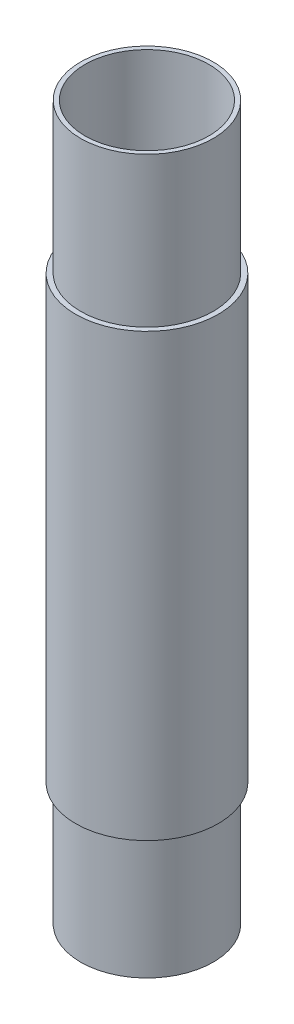
ISO-10303-21;
HEADER;
FILE_DESCRIPTION(('STEP AP214'),'2;1');
FILE_NAME('part.step','',(''),(''),'','','');
FILE_SCHEMA(('AUTOMOTIVE_DESIGN { 1 0 10303 214 1 1 1 1 }'));
ENDSEC;
DATA;
#1=APPLICATION_CONTEXT('core data for automotive mechanical design processes');
#2=APPLICATION_PROTOCOL_DEFINITION('international standard','automotive_design',2000,#1);
#3=PRODUCT_CONTEXT('',#1,'mechanical');
#4=PRODUCT('Part','Part','',(#3));
#5=PRODUCT_RELATED_PRODUCT_CATEGORY('part','',(#4));
#6=PRODUCT_DEFINITION_FORMATION('','',#4);
#7=PRODUCT_DEFINITION_CONTEXT('part definition',#1,'design');
#8=PRODUCT_DEFINITION('design','',#6,#7);
#9=PRODUCT_DEFINITION_SHAPE('','',#8);
#10=(LENGTH_UNIT() NAMED_UNIT(*) SI_UNIT(.MILLI.,.METRE.));
#11=(NAMED_UNIT(*) PLANE_ANGLE_UNIT() SI_UNIT($,.RADIAN.));
#12=(NAMED_UNIT(*) SI_UNIT($,.STERADIAN.) SOLID_ANGLE_UNIT());
#13=UNCERTAINTY_MEASURE_WITH_UNIT(LENGTH_MEASURE(1.E-05),#10,'distance_accuracy_value','');
#14=(GEOMETRIC_REPRESENTATION_CONTEXT(3) GLOBAL_UNCERTAINTY_ASSIGNED_CONTEXT((#13)) GLOBAL_UNIT_ASSIGNED_CONTEXT((#10,
#11,#12)) REPRESENTATION_CONTEXT('',''));
#15=CARTESIAN_POINT('',(0.,0.,0.));
#16=DIRECTION('',(0.,0.,1.));
#17=DIRECTION('',(1.,0.,0.));
#18=AXIS2_PLACEMENT_3D('',#15,#16,#17);
#19=CARTESIAN_POINT('',(0.,230.,0.));
#20=DIRECTION('',(0.,-1.,0.));
#21=DIRECTION('',(0.,0.,-1.));
#22=AXIS2_PLACEMENT_3D('',#19,#20,#21);
#23=CYLINDRICAL_SURFACE('',#22,27.06751);
#24=CARTESIAN_POINT('',(0.,80.,0.));
#25=DIRECTION('',(0.,1.,0.));
#26=DIRECTION('',(0.,0.,1.));
#27=AXIS2_PLACEMENT_3D('',#24,#25,#26);
#28=CIRCLE('',#27,27.06751);
#29=CARTESIAN_POINT('',(0.,80.,27.06751));
#30=VERTEX_POINT('',#29);
#31=EDGE_CURVE('E56',#30,#30,#28,.F.);
#32=ORIENTED_EDGE('',*,*,#31,.T.);
#33=EDGE_LOOP('',(#32));
#34=FACE_BOUND('',#33,.T.);
#35=CARTESIAN_POINT('',(0.,200.,0.));
#36=DIRECTION('',(0.,1.,0.));
#37=DIRECTION('',(0.,0.,1.));
#38=AXIS2_PLACEMENT_3D('',#35,#36,#37);
#39=CIRCLE('',#38,27.06751);
#40=CARTESIAN_POINT('',(0.,200.,27.06751));
#41=VERTEX_POINT('',#40);
#42=EDGE_CURVE('E84',#41,#41,#39,.T.);
#43=ORIENTED_EDGE('',*,*,#42,.T.);
#44=EDGE_LOOP('',(#43));
#45=FACE_BOUND('',#44,.T.);
#46=ADVANCED_FACE('F37',(#34,#45),#23,.F.);
#47=CARTESIAN_POINT('',(0.,80.,0.));
#48=DIRECTION('',(0.,-1.,0.));
#49=DIRECTION('',(0.,0.,-1.));
#50=AXIS2_PLACEMENT_3D('',#47,#48,#49);
#51=CYLINDRICAL_SURFACE('',#50,27.06751);
#52=CARTESIAN_POINT('',(0.,0.,0.));
#53=DIRECTION('',(0.,1.,0.));
#54=DIRECTION('',(0.,0.,1.));
#55=AXIS2_PLACEMENT_3D('',#52,#53,#54);
#56=CIRCLE('',#55,27.06751);
#57=CARTESIAN_POINT('',(0.,0.,27.06751));
#58=VERTEX_POINT('',#57);
#59=EDGE_CURVE('E48',#58,#58,#56,.T.);
#60=ORIENTED_EDGE('',*,*,#59,.T.);
#61=EDGE_LOOP('',(#60));
#62=FACE_BOUND('',#61,.T.);
#63=CARTESIAN_POINT('',(0.,50.,0.));
#64=DIRECTION('',(0.,1.,0.));
#65=DIRECTION('',(0.,0.,1.));
#66=AXIS2_PLACEMENT_3D('',#63,#64,#65);
#67=CIRCLE('',#66,27.06751);
#68=CARTESIAN_POINT('',(0.,50.,27.06751));
#69=VERTEX_POINT('',#68);
#70=EDGE_CURVE('E10',#69,#69,#67,.T.);
#71=ORIENTED_EDGE('',*,*,#70,.F.);
#72=EDGE_LOOP('',(#71));
#73=FACE_BOUND('',#72,.T.);
#74=ADVANCED_FACE('F106',(#62,#73),#51,.T.);
#75=CARTESIAN_POINT('',(0.,80.,0.));
#76=DIRECTION('',(0.,-1.,0.));
#77=DIRECTION('',(0.,0.,-1.));
#78=AXIS2_PLACEMENT_3D('',#75,#76,#77);
#79=CYLINDRICAL_SURFACE('',#78,25.29025);
#80=CARTESIAN_POINT('',(0.,80.,0.));
#81=DIRECTION('',(0.,1.,0.));
#82=DIRECTION('',(0.,0.,1.));
#83=AXIS2_PLACEMENT_3D('',#80,#81,#82);
#84=CIRCLE('',#83,25.29025);
#85=CARTESIAN_POINT('',(0.,80.,25.29025));
#86=VERTEX_POINT('',#85);
#87=EDGE_CURVE('E44',#86,#86,#84,.T.);
#88=ORIENTED_EDGE('',*,*,#87,.T.);
#89=EDGE_LOOP('',(#88));
#90=FACE_BOUND('',#89,.T.);
#91=CARTESIAN_POINT('',(0.,0.,0.));
#92=DIRECTION('',(0.,1.,0.));
#93=DIRECTION('',(0.,0.,1.));
#94=AXIS2_PLACEMENT_3D('',#91,#92,#93);
#95=CIRCLE('',#94,25.29025);
#96=CARTESIAN_POINT('',(0.,0.,25.29025));
#97=VERTEX_POINT('',#96);
#98=EDGE_CURVE('E53',#97,#97,#95,.T.);
#99=ORIENTED_EDGE('',*,*,#98,.F.);
#100=EDGE_LOOP('',(#99));
#101=FACE_BOUND('',#100,.T.);
#102=ADVANCED_FACE('F39',(#90,#101),#79,.F.);
#103=CARTESIAN_POINT('',(0.,80.,0.));
#104=DIRECTION('',(0.,1.,0.));
#105=DIRECTION('',(0.,0.,1.));
#106=AXIS2_PLACEMENT_3D('',#103,#104,#105);
#107=PLANE('',#106);
#108=ORIENTED_EDGE('',*,*,#87,.F.);
#109=EDGE_LOOP('',(#108));
#110=FACE_BOUND('',#109,.T.);
#111=ORIENTED_EDGE('',*,*,#31,.F.);
#112=EDGE_LOOP('',(#111));
#113=FACE_BOUND('',#112,.T.);
#114=ADVANCED_FACE('F116',(#110,#113),#107,.T.);
#115=CARTESIAN_POINT('',(0.,0.,0.));
#116=DIRECTION('',(0.,1.,0.));
#117=DIRECTION('',(0.,0.,1.));
#118=AXIS2_PLACEMENT_3D('',#115,#116,#117);
#119=PLANE('',#118);
#120=ORIENTED_EDGE('',*,*,#98,.T.);
#121=EDGE_LOOP('',(#120));
#122=FACE_BOUND('',#121,.T.);
#123=ORIENTED_EDGE('',*,*,#59,.F.);
#124=EDGE_LOOP('',(#123));
#125=FACE_BOUND('',#124,.T.);
#126=ADVANCED_FACE('F119',(#122,#125),#119,.F.);
#127=CARTESIAN_POINT('',(0.,230.,0.));
#128=DIRECTION('',(0.,-1.,0.));
#129=DIRECTION('',(0.,0.,-1.));
#130=AXIS2_PLACEMENT_3D('',#127,#128,#129);
#131=CYLINDRICAL_SURFACE('',#130,29.1211);
#132=CARTESIAN_POINT('',(0.,230.,0.));
#133=DIRECTION('',(0.,1.,0.));
#134=DIRECTION('',(0.,0.,1.));
#135=AXIS2_PLACEMENT_3D('',#132,#133,#134);
#136=CIRCLE('',#135,29.1211);
#137=CARTESIAN_POINT('',(0.,230.,29.1211));
#138=VERTEX_POINT('',#137);
#139=EDGE_CURVE('E62',#138,#138,#136,.T.);
#140=ORIENTED_EDGE('',*,*,#139,.F.);
#141=EDGE_LOOP('',(#140));
#142=FACE_BOUND('',#141,.T.);
#143=CARTESIAN_POINT('',(0.,50.,0.));
#144=DIRECTION('',(0.,1.,0.));
#145=DIRECTION('',(0.,0.,1.));
#146=AXIS2_PLACEMENT_3D('',#143,#144,#145);
#147=CIRCLE('',#146,29.1211);
#148=CARTESIAN_POINT('',(0.,50.,29.1211));
#149=VERTEX_POINT('',#148);
#150=EDGE_CURVE('E71',#149,#149,#147,.T.);
#151=ORIENTED_EDGE('',*,*,#150,.T.);
#152=EDGE_LOOP('',(#151));
#153=FACE_BOUND('',#152,.T.);
#154=ADVANCED_FACE('F114',(#142,#153),#131,.T.);
#155=CARTESIAN_POINT('',(0.,230.,0.));
#156=DIRECTION('',(0.,1.,0.));
#157=DIRECTION('',(0.,0.,1.));
#158=AXIS2_PLACEMENT_3D('',#155,#156,#157);
#159=PLANE('',#158);
#160=CARTESIAN_POINT('',(0.,230.,0.));
#161=DIRECTION('',(0.,1.,0.));
#162=DIRECTION('',(0.,0.,1.));
#163=AXIS2_PLACEMENT_3D('',#160,#161,#162);
#164=CIRCLE('',#163,27.06751);
#165=CARTESIAN_POINT('',(0.,230.,27.06751));
#166=VERTEX_POINT('',#165);
#167=EDGE_CURVE('E66',#166,#166,#164,.T.);
#168=ORIENTED_EDGE('',*,*,#167,.F.);
#169=EDGE_LOOP('',(#168));
#170=FACE_BOUND('',#169,.T.);
#171=ORIENTED_EDGE('',*,*,#139,.T.);
#172=EDGE_LOOP('',(#171));
#173=FACE_BOUND('',#172,.T.);
#174=ADVANCED_FACE('F125',(#170,#173),#159,.T.);
#175=CARTESIAN_POINT('',(0.,50.,0.));
#176=DIRECTION('',(0.,1.,0.));
#177=DIRECTION('',(0.,0.,1.));
#178=AXIS2_PLACEMENT_3D('',#175,#176,#177);
#179=PLANE('',#178);
#180=ORIENTED_EDGE('',*,*,#70,.T.);
#181=EDGE_LOOP('',(#180));
#182=FACE_BOUND('',#181,.T.);
#183=ORIENTED_EDGE('',*,*,#150,.F.);
#184=EDGE_LOOP('',(#183));
#185=FACE_BOUND('',#184,.T.);
#186=ADVANCED_FACE('F133',(#182,#185),#179,.F.);
#187=CARTESIAN_POINT('',(0.,291.12,0.));
#188=DIRECTION('',(0.,-1.,0.));
#189=DIRECTION('',(0.,0.,-1.));
#190=AXIS2_PLACEMENT_3D('',#187,#188,#189);
#191=CYLINDRICAL_SURFACE('',#190,25.29025);
#192=CARTESIAN_POINT('',(0.,291.12,0.));
#193=DIRECTION('',(0.,1.,0.));
#194=DIRECTION('',(0.,0.,1.));
#195=AXIS2_PLACEMENT_3D('',#192,#193,#194);
#196=CIRCLE('',#195,25.29025);
#197=CARTESIAN_POINT('',(0.,291.12,25.29025));
#198=VERTEX_POINT('',#197);
#199=EDGE_CURVE('E79',#198,#198,#196,.T.);
#200=ORIENTED_EDGE('',*,*,#199,.T.);
#201=EDGE_LOOP('',(#200));
#202=FACE_BOUND('',#201,.T.);
#203=CARTESIAN_POINT('',(0.,200.,0.));
#204=DIRECTION('',(0.,1.,0.));
#205=DIRECTION('',(0.,0.,1.));
#206=AXIS2_PLACEMENT_3D('',#203,#204,#205);
#207=CIRCLE('',#206,25.29025);
#208=CARTESIAN_POINT('',(0.,200.,25.29025));
#209=VERTEX_POINT('',#208);
#210=EDGE_CURVE('E87',#209,#209,#207,.T.);
#211=ORIENTED_EDGE('',*,*,#210,.F.);
#212=EDGE_LOOP('',(#211));
#213=FACE_BOUND('',#212,.T.);
#214=ADVANCED_FACE('F139',(#202,#213),#191,.F.);
#215=CARTESIAN_POINT('',(0.,291.12,0.));
#216=DIRECTION('',(0.,-1.,0.));
#217=DIRECTION('',(0.,0.,-1.));
#218=AXIS2_PLACEMENT_3D('',#215,#216,#217);
#219=CYLINDRICAL_SURFACE('',#218,27.06751);
#220=ORIENTED_EDGE('',*,*,#167,.T.);
#221=EDGE_LOOP('',(#220));
#222=FACE_BOUND('',#221,.T.);
#223=CARTESIAN_POINT('',(0.,291.12,0.));
#224=DIRECTION('',(0.,1.,0.));
#225=DIRECTION('',(0.,0.,1.));
#226=AXIS2_PLACEMENT_3D('',#223,#224,#225);
#227=CIRCLE('',#226,27.06751);
#228=CARTESIAN_POINT('',(0.,291.12,27.06751));
#229=VERTEX_POINT('',#228);
#230=EDGE_CURVE('E75',#229,#229,#227,.T.);
#231=ORIENTED_EDGE('',*,*,#230,.F.);
#232=EDGE_LOOP('',(#231));
#233=FACE_BOUND('',#232,.T.);
#234=ADVANCED_FACE('F101',(#222,#233),#219,.T.);
#235=CARTESIAN_POINT('',(0.,291.12,0.));
#236=DIRECTION('',(0.,1.,0.));
#237=DIRECTION('',(0.,0.,1.));
#238=AXIS2_PLACEMENT_3D('',#235,#236,#237);
#239=PLANE('',#238);
#240=ORIENTED_EDGE('',*,*,#199,.F.);
#241=EDGE_LOOP('',(#240));
#242=FACE_BOUND('',#241,.T.);
#243=ORIENTED_EDGE('',*,*,#230,.T.);
#244=EDGE_LOOP('',(#243));
#245=FACE_BOUND('',#244,.T.);
#246=ADVANCED_FACE('F95',(#242,#245),#239,.T.);
#247=CARTESIAN_POINT('',(0.,200.,0.));
#248=DIRECTION('',(0.,1.,0.));
#249=DIRECTION('',(0.,0.,1.));
#250=AXIS2_PLACEMENT_3D('',#247,#248,#249);
#251=PLANE('',#250);
#252=ORIENTED_EDGE('',*,*,#210,.T.);
#253=EDGE_LOOP('',(#252));
#254=FACE_BOUND('',#253,.T.);
#255=ORIENTED_EDGE('',*,*,#42,.F.);
#256=EDGE_LOOP('',(#255));
#257=FACE_BOUND('',#256,.T.);
#258=ADVANCED_FACE('F93',(#254,#257),#251,.F.);
#259=CLOSED_SHELL('',(#46,#74,#102,#114,#126,#154,#174,#186,#214,#234,#246,#258));
#260=MANIFOLD_SOLID_BREP('B2',#259);
#261=ADVANCED_BREP_SHAPE_REPRESENTATION('',(#18,#260),#14);
#262=SHAPE_DEFINITION_REPRESENTATION(#9,#261);
ENDSEC;
END-ISO-10303-21;
